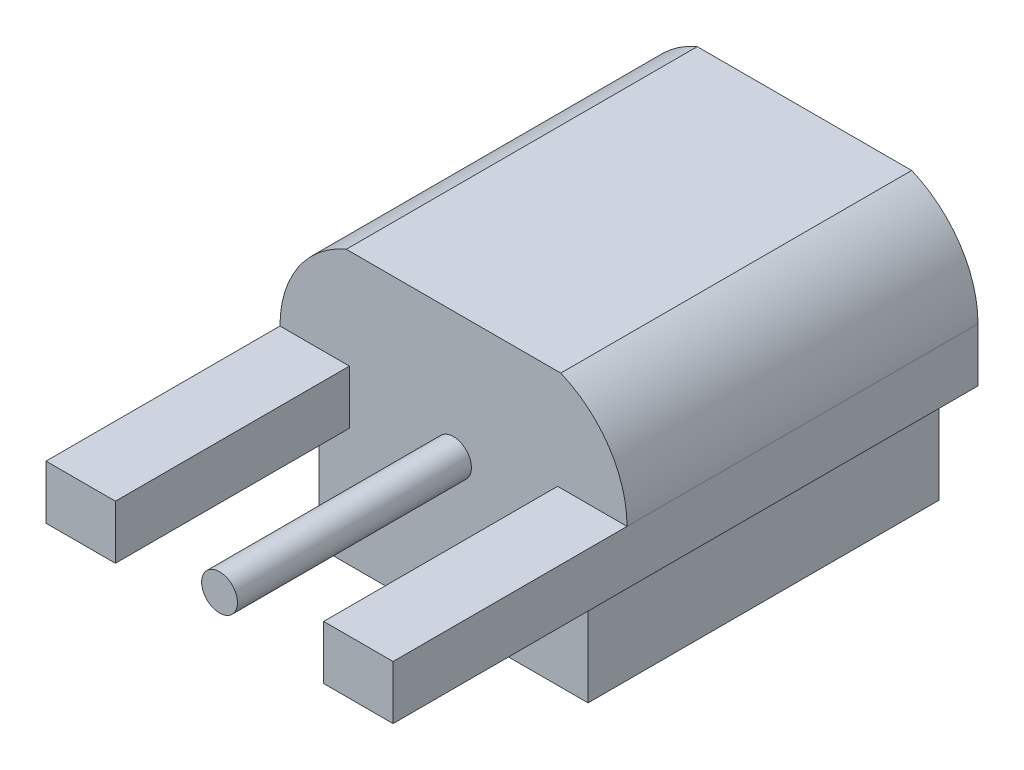
ISO-10303-21;
HEADER;
FILE_DESCRIPTION(('STEP AP214'),'2;1');
FILE_NAME('part.step','',(''),(''),'','','');
FILE_SCHEMA(('AUTOMOTIVE_DESIGN { 1 0 10303 214 1 1 1 1 }'));
ENDSEC;
DATA;
#1=APPLICATION_CONTEXT('core data for automotive mechanical design processes');
#2=APPLICATION_PROTOCOL_DEFINITION('international standard','automotive_design',2000,#1);
#3=PRODUCT_CONTEXT('',#1,'mechanical');
#4=PRODUCT('Part','Part','',(#3));
#5=PRODUCT_RELATED_PRODUCT_CATEGORY('part','',(#4));
#6=PRODUCT_DEFINITION_FORMATION('','',#4);
#7=PRODUCT_DEFINITION_CONTEXT('part definition',#1,'design');
#8=PRODUCT_DEFINITION('design','',#6,#7);
#9=PRODUCT_DEFINITION_SHAPE('','',#8);
#10=(LENGTH_UNIT() NAMED_UNIT(*) SI_UNIT(.MILLI.,.METRE.));
#11=(NAMED_UNIT(*) PLANE_ANGLE_UNIT() SI_UNIT($,.RADIAN.));
#12=(NAMED_UNIT(*) SI_UNIT($,.STERADIAN.) SOLID_ANGLE_UNIT());
#13=UNCERTAINTY_MEASURE_WITH_UNIT(LENGTH_MEASURE(1.E-05),#10,'distance_accuracy_value','');
#14=(GEOMETRIC_REPRESENTATION_CONTEXT(3) GLOBAL_UNCERTAINTY_ASSIGNED_CONTEXT((#13)) GLOBAL_UNIT_ASSIGNED_CONTEXT((#10,
#11,#12)) REPRESENTATION_CONTEXT('',''));
#15=CARTESIAN_POINT('',(0.,0.,0.));
#16=DIRECTION('',(0.,0.,1.));
#17=DIRECTION('',(1.,0.,0.));
#18=AXIS2_PLACEMENT_3D('',#15,#16,#17);
#19=CARTESIAN_POINT('',(2.225,0.345,0.));
#20=DIRECTION('',(0.,0.,-1.));
#21=DIRECTION('',(-1.,0.,0.));
#22=AXIS2_PLACEMENT_3D('',#19,#20,#21);
#23=CYLINDRICAL_SURFACE('',#22,0.229716396308532);
#24=CARTESIAN_POINT('',(2.225,0.345,0.));
#25=DIRECTION('',(0.,0.,1.));
#26=DIRECTION('',(1.,0.,0.));
#27=AXIS2_PLACEMENT_3D('',#24,#25,#26);
#28=CIRCLE('',#27,0.229716396308532);
#29=CARTESIAN_POINT('',(2.45471639630853,0.345,0.));
#30=VERTEX_POINT('',#29);
#31=EDGE_CURVE('E11',#30,#30,#28,.T.);
#32=ORIENTED_EDGE('',*,*,#31,.F.);
#33=EDGE_LOOP('',(#32));
#34=FACE_BOUND('',#33,.T.);
#35=CARTESIAN_POINT('',(2.225,0.345,-3.));
#36=DIRECTION('',(0.,0.,1.));
#37=DIRECTION('',(1.,0.,0.));
#38=AXIS2_PLACEMENT_3D('',#35,#36,#37);
#39=CIRCLE('',#38,0.229716396308532);
#40=CARTESIAN_POINT('',(2.45471639630853,0.345,-3.));
#41=VERTEX_POINT('',#40);
#42=EDGE_CURVE('E43',#41,#41,#39,.T.);
#43=ORIENTED_EDGE('',*,*,#42,.T.);
#44=EDGE_LOOP('',(#43));
#45=FACE_BOUND('',#44,.T.);
#46=ADVANCED_FACE('F40',(#34,#45),#23,.T.);
#47=CARTESIAN_POINT('',(2.225,0.345,0.));
#48=DIRECTION('',(0.,0.,1.));
#49=DIRECTION('',(1.,0.,0.));
#50=AXIS2_PLACEMENT_3D('',#47,#48,#49);
#51=PLANE('',#50);
#52=ORIENTED_EDGE('',*,*,#31,.T.);
#53=EDGE_LOOP('',(#52));
#54=FACE_BOUND('',#53,.T.);
#55=ADVANCED_FACE('F55',(#54),#51,.T.);
#56=CARTESIAN_POINT('',(2.225,0.345,-3.));
#57=DIRECTION('',(0.,0.,1.));
#58=DIRECTION('',(1.,0.,0.));
#59=AXIS2_PLACEMENT_3D('',#56,#57,#58);
#60=PLANE('',#59);
#61=ORIENTED_EDGE('',*,*,#42,.F.);
#62=EDGE_LOOP('',(#61));
#63=FACE_BOUND('',#62,.T.);
#64=ADVANCED_FACE('F53',(#63),#60,.F.);
#65=CLOSED_SHELL('',(#46,#55,#64));
#66=MANIFOLD_SOLID_BREP('B2',#65);
#67=CARTESIAN_POINT('',(0.,0.69,0.));
#68=DIRECTION('',(0.,-1.,0.));
#69=DIRECTION('',(0.,0.,-1.));
#70=AXIS2_PLACEMENT_3D('',#67,#68,#69);
#71=PLANE('',#70);
#72=DIRECTION('',(0.,0.,-1.));
#73=VECTOR('',#72,1.);
#74=CARTESIAN_POINT('',(4.45,0.69,-7.5));
#75=LINE('',#74,#73);
#76=CARTESIAN_POINT('',(4.45,0.69,0.));
#77=VERTEX_POINT('',#76);
#78=CARTESIAN_POINT('',(4.45,0.69,-3.));
#79=VERTEX_POINT('',#78);
#80=EDGE_CURVE('E214',#77,#79,#75,.T.);
#81=ORIENTED_EDGE('',*,*,#80,.T.);
#82=DIRECTION('',(-1.,0.,0.));
#83=VECTOR('',#82,1.);
#84=CARTESIAN_POINT('',(0.,0.69,-3.));
#85=LINE('',#84,#83);
#86=CARTESIAN_POINT('',(3.56,0.69,-3.));
#87=VERTEX_POINT('',#86);
#88=EDGE_CURVE('E189',#79,#87,#85,.T.);
#89=ORIENTED_EDGE('',*,*,#88,.T.);
#90=DIRECTION('',(0.,0.,1.));
#91=VECTOR('',#90,1.);
#92=CARTESIAN_POINT('',(3.56,0.69,0.));
#93=LINE('',#92,#91);
#94=CARTESIAN_POINT('',(3.56,0.69,0.));
#95=VERTEX_POINT('',#94);
#96=EDGE_CURVE('E227',#87,#95,#93,.T.);
#97=ORIENTED_EDGE('',*,*,#96,.T.);
#98=DIRECTION('',(1.,0.,0.));
#99=VECTOR('',#98,1.);
#100=CARTESIAN_POINT('',(4.45,0.69,0.));
#101=LINE('',#100,#99);
#102=EDGE_CURVE('E221',#95,#77,#101,.T.);
#103=ORIENTED_EDGE('',*,*,#102,.T.);
#104=EDGE_LOOP('',(#81,#89,#97,#103));
#105=FACE_BOUND('',#104,.T.);
#106=ADVANCED_FACE('F80',(#105),#71,.F.);
#107=CARTESIAN_POINT('',(0.,0.,0.));
#108=DIRECTION('',(0.,-1.,0.));
#109=DIRECTION('',(0.,0.,-1.));
#110=AXIS2_PLACEMENT_3D('',#107,#108,#109);
#111=PLANE('',#110);
#112=DIRECTION('',(0.,0.,-1.));
#113=VECTOR('',#112,1.);
#114=CARTESIAN_POINT('',(0.5,0.,-7.5));
#115=LINE('',#114,#113);
#116=CARTESIAN_POINT('',(0.5,0.,-3.));
#117=VERTEX_POINT('',#116);
#118=CARTESIAN_POINT('',(0.5,0.,-7.5));
#119=VERTEX_POINT('',#118);
#120=EDGE_CURVE('E105',#117,#119,#115,.T.);
#121=ORIENTED_EDGE('',*,*,#120,.F.);
#122=DIRECTION('',(-1.,0.,0.));
#123=VECTOR('',#122,1.);
#124=CARTESIAN_POINT('',(0.5,0.,-3.));
#125=LINE('',#124,#123);
#126=CARTESIAN_POINT('',(0.89,0.,-3.));
#127=VERTEX_POINT('',#126);
#128=EDGE_CURVE('E89',#127,#117,#125,.T.);
#129=ORIENTED_EDGE('',*,*,#128,.F.);
#130=DIRECTION('',(0.,0.,-1.));
#131=VECTOR('',#130,1.);
#132=CARTESIAN_POINT('',(0.89,0.,-3.));
#133=LINE('',#132,#131);
#134=CARTESIAN_POINT('',(0.89,0.,0.));
#135=VERTEX_POINT('',#134);
#136=EDGE_CURVE('E245',#135,#127,#133,.T.);
#137=ORIENTED_EDGE('',*,*,#136,.F.);
#138=DIRECTION('',(1.,0.,0.));
#139=VECTOR('',#138,1.);
#140=CARTESIAN_POINT('',(0.89,0.,0.));
#141=LINE('',#140,#139);
#142=CARTESIAN_POINT('',(0.,0.,0.));
#143=VERTEX_POINT('',#142);
#144=EDGE_CURVE('E242',#143,#135,#141,.T.);
#145=ORIENTED_EDGE('',*,*,#144,.F.);
#146=DIRECTION('',(0.,0.,1.));
#147=VECTOR('',#146,1.);
#148=CARTESIAN_POINT('',(0.,0.,0.));
#149=LINE('',#148,#147);
#150=CARTESIAN_POINT('',(0.,0.,-7.5));
#151=VERTEX_POINT('',#150);
#152=EDGE_CURVE('E239',#151,#143,#149,.T.);
#153=ORIENTED_EDGE('',*,*,#152,.F.);
#154=DIRECTION('',(-1.,0.,0.));
#155=VECTOR('',#154,1.);
#156=CARTESIAN_POINT('',(0.,0.,-7.5));
#157=LINE('',#156,#155);
#158=EDGE_CURVE('E251',#119,#151,#157,.T.);
#159=ORIENTED_EDGE('',*,*,#158,.F.);
#160=EDGE_LOOP('',(#121,#129,#137,#145,#153,#159));
#161=FACE_BOUND('',#160,.T.);
#162=ADVANCED_FACE('F393',(#161),#111,.T.);
#163=CARTESIAN_POINT('',(0.,0.69,0.));
#164=DIRECTION('',(1.,0.,0.));
#165=DIRECTION('',(0.,0.,-1.));
#166=AXIS2_PLACEMENT_3D('',#163,#164,#165);
#167=PLANE('',#166);
#168=ORIENTED_EDGE('',*,*,#152,.T.);
#169=DIRECTION('',(0.,-1.,0.));
#170=VECTOR('',#169,1.);
#171=CARTESIAN_POINT('',(0.,0.69,0.));
#172=LINE('',#171,#170);
#173=CARTESIAN_POINT('',(0.,0.69,0.));
#174=VERTEX_POINT('',#173);
#175=EDGE_CURVE('E262',#174,#143,#172,.T.);
#176=ORIENTED_EDGE('',*,*,#175,.F.);
#177=DIRECTION('',(0.,0.,1.));
#178=VECTOR('',#177,1.);
#179=CARTESIAN_POINT('',(0.,0.69,0.));
#180=LINE('',#179,#178);
#181=CARTESIAN_POINT('',(0.,0.69,-3.));
#182=VERTEX_POINT('',#181);
#183=EDGE_CURVE('E261',#182,#174,#180,.T.);
#184=ORIENTED_EDGE('',*,*,#183,.F.);
#185=CARTESIAN_POINT('',(0.,0.69,-7.5));
#186=VERTEX_POINT('',#185);
#187=EDGE_CURVE('E231',#186,#182,#180,.T.);
#188=ORIENTED_EDGE('',*,*,#187,.F.);
#189=DIRECTION('',(0.,-1.,0.));
#190=VECTOR('',#189,1.);
#191=CARTESIAN_POINT('',(0.,0.69,-7.5));
#192=LINE('',#191,#190);
#193=EDGE_CURVE('E223',#186,#151,#192,.T.);
#194=ORIENTED_EDGE('',*,*,#193,.T.);
#195=EDGE_LOOP('',(#168,#176,#184,#188,#194));
#196=FACE_BOUND('',#195,.T.);
#197=ADVANCED_FACE('F82',(#196),#167,.F.);
#198=CARTESIAN_POINT('',(0.89,0.69,0.));
#199=DIRECTION('',(0.,0.,-1.));
#200=DIRECTION('',(-1.,0.,0.));
#201=AXIS2_PLACEMENT_3D('',#198,#199,#200);
#202=PLANE('',#201);
#203=ORIENTED_EDGE('',*,*,#144,.T.);
#204=DIRECTION('',(0.,-1.,0.));
#205=VECTOR('',#204,1.);
#206=CARTESIAN_POINT('',(0.89,0.69,0.));
#207=LINE('',#206,#205);
#208=CARTESIAN_POINT('',(0.89,0.69,0.));
#209=VERTEX_POINT('',#208);
#210=EDGE_CURVE('E265',#209,#135,#207,.T.);
#211=ORIENTED_EDGE('',*,*,#210,.F.);
#212=DIRECTION('',(1.,0.,0.));
#213=VECTOR('',#212,1.);
#214=CARTESIAN_POINT('',(0.89,0.69,0.));
#215=LINE('',#214,#213);
#216=EDGE_CURVE('E319',#174,#209,#215,.T.);
#217=ORIENTED_EDGE('',*,*,#216,.F.);
#218=ORIENTED_EDGE('',*,*,#175,.T.);
#219=EDGE_LOOP('',(#203,#211,#217,#218));
#220=FACE_BOUND('',#219,.T.);
#221=ADVANCED_FACE('F423',(#220),#202,.F.);
#222=CARTESIAN_POINT('',(0.89,0.69,-3.));
#223=DIRECTION('',(-1.,0.,0.));
#224=DIRECTION('',(0.,0.,1.));
#225=AXIS2_PLACEMENT_3D('',#222,#223,#224);
#226=PLANE('',#225);
#227=ORIENTED_EDGE('',*,*,#136,.T.);
#228=DIRECTION('',(0.,-1.,0.));
#229=VECTOR('',#228,1.);
#230=CARTESIAN_POINT('',(0.89,0.69,-3.));
#231=LINE('',#230,#229);
#232=CARTESIAN_POINT('',(0.89,0.69,-3.));
#233=VERTEX_POINT('',#232);
#234=EDGE_CURVE('E268',#233,#127,#231,.T.);
#235=ORIENTED_EDGE('',*,*,#234,.F.);
#236=DIRECTION('',(0.,0.,-1.));
#237=VECTOR('',#236,1.);
#238=CARTESIAN_POINT('',(0.89,0.69,-3.));
#239=LINE('',#238,#237);
#240=EDGE_CURVE('E343',#209,#233,#239,.T.);
#241=ORIENTED_EDGE('',*,*,#240,.F.);
#242=ORIENTED_EDGE('',*,*,#210,.T.);
#243=EDGE_LOOP('',(#227,#235,#241,#242));
#244=FACE_BOUND('',#243,.T.);
#245=ADVANCED_FACE('F336',(#244),#226,.F.);
#246=CARTESIAN_POINT('',(3.56,0.69,-3.));
#247=DIRECTION('',(0.,0.,-1.));
#248=DIRECTION('',(-1.,0.,0.));
#249=AXIS2_PLACEMENT_3D('',#246,#247,#248);
#250=PLANE('',#249);
#251=ORIENTED_EDGE('',*,*,#234,.T.);
#252=ORIENTED_EDGE('',*,*,#128,.T.);
#253=DIRECTION('',(0.,1.,0.));
#254=VECTOR('',#253,1.);
#255=CARTESIAN_POINT('',(0.5,-1.52,-3.));
#256=LINE('',#255,#254);
#257=CARTESIAN_POINT('',(0.5,-1.52,-3.));
#258=VERTEX_POINT('',#257);
#259=EDGE_CURVE('E315',#258,#117,#256,.T.);
#260=ORIENTED_EDGE('',*,*,#259,.F.);
#261=DIRECTION('',(-1.,0.,0.));
#262=VECTOR('',#261,1.);
#263=CARTESIAN_POINT('',(0.5,-1.52,-3.));
#264=LINE('',#263,#262);
#265=CARTESIAN_POINT('',(3.95,-1.52,-3.));
#266=VERTEX_POINT('',#265);
#267=EDGE_CURVE('E313',#266,#258,#264,.T.);
#268=ORIENTED_EDGE('',*,*,#267,.F.);
#269=DIRECTION('',(0.,1.,0.));
#270=VECTOR('',#269,1.);
#271=CARTESIAN_POINT('',(3.95,-1.52,-3.));
#272=LINE('',#271,#270);
#273=CARTESIAN_POINT('',(3.95,0.,-3.));
#274=VERTEX_POINT('',#273);
#275=EDGE_CURVE('E301',#266,#274,#272,.T.);
#276=ORIENTED_EDGE('',*,*,#275,.T.);
#277=CARTESIAN_POINT('',(3.56,0.,-3.));
#278=VERTEX_POINT('',#277);
#279=EDGE_CURVE('E287',#274,#278,#125,.T.);
#280=ORIENTED_EDGE('',*,*,#279,.T.);
#281=DIRECTION('',(0.,-1.,0.));
#282=VECTOR('',#281,1.);
#283=CARTESIAN_POINT('',(3.56,0.69,-3.));
#284=LINE('',#283,#282);
#285=EDGE_CURVE('E196',#87,#278,#284,.T.);
#286=ORIENTED_EDGE('',*,*,#285,.F.);
#287=ORIENTED_EDGE('',*,*,#88,.F.);
#288=CARTESIAN_POINT('',(3.06511635639883,0.69,-3.));
#289=DIRECTION('',(0.,0.,-1.));
#290=DIRECTION('',(1.,0.,0.));
#291=AXIS2_PLACEMENT_3D('',#288,#289,#290);
#292=CIRCLE('',#291,1.38488364360117);
#293=CARTESIAN_POINT('',(3.6,1.96742013218909,-3.));
#294=VERTEX_POINT('',#293);
#295=EDGE_CURVE('E193',#294,#79,#292,.T.);
#296=ORIENTED_EDGE('',*,*,#295,.F.);
#297=DIRECTION('',(1.,0.,0.));
#298=VECTOR('',#297,1.);
#299=CARTESIAN_POINT('',(3.6,1.96742013218909,-3.));
#300=LINE('',#299,#298);
#301=CARTESIAN_POINT('',(0.85,1.96742013218909,-3.));
#302=VERTEX_POINT('',#301);
#303=EDGE_CURVE('E218',#302,#294,#300,.T.);
#304=ORIENTED_EDGE('',*,*,#303,.F.);
#305=CARTESIAN_POINT('',(1.38488364360117,0.69,-3.));
#306=DIRECTION('',(0.,0.,-1.));
#307=DIRECTION('',(-1.,0.,0.));
#308=AXIS2_PLACEMENT_3D('',#305,#306,#307);
#309=CIRCLE('',#308,1.38488364360117);
#310=EDGE_CURVE('E97',#182,#302,#309,.T.);
#311=ORIENTED_EDGE('',*,*,#310,.F.);
#312=EDGE_CURVE('E38',#233,#182,#85,.T.);
#313=ORIENTED_EDGE('',*,*,#312,.F.);
#314=EDGE_LOOP('',(#251,#252,#260,#268,#276,#280,#286,#287,#296,#304,#311,#313));
#315=FACE_BOUND('',#314,.T.);
#316=ADVANCED_FACE('F192',(#315),#250,.F.);
#317=CARTESIAN_POINT('',(3.56,0.69,0.));
#318=DIRECTION('',(1.,0.,0.));
#319=DIRECTION('',(0.,0.,-1.));
#320=AXIS2_PLACEMENT_3D('',#317,#318,#319);
#321=PLANE('',#320);
#322=DIRECTION('',(0.,0.,1.));
#323=VECTOR('',#322,1.);
#324=CARTESIAN_POINT('',(3.56,0.,0.));
#325=LINE('',#324,#323);
#326=CARTESIAN_POINT('',(3.56,0.,0.));
#327=VERTEX_POINT('',#326);
#328=EDGE_CURVE('E249',#278,#327,#325,.T.);
#329=ORIENTED_EDGE('',*,*,#328,.T.);
#330=DIRECTION('',(0.,-1.,0.));
#331=VECTOR('',#330,1.);
#332=CARTESIAN_POINT('',(3.56,0.69,0.));
#333=LINE('',#332,#331);
#334=EDGE_CURVE('E269',#95,#327,#333,.T.);
#335=ORIENTED_EDGE('',*,*,#334,.F.);
#336=ORIENTED_EDGE('',*,*,#96,.F.);
#337=ORIENTED_EDGE('',*,*,#285,.T.);
#338=EDGE_LOOP('',(#329,#335,#336,#337));
#339=FACE_BOUND('',#338,.T.);
#340=ADVANCED_FACE('F415',(#339),#321,.F.);
#341=CARTESIAN_POINT('',(4.45,0.69,0.));
#342=DIRECTION('',(0.,0.,-1.));
#343=DIRECTION('',(-1.,0.,0.));
#344=AXIS2_PLACEMENT_3D('',#341,#342,#343);
#345=PLANE('',#344);
#346=DIRECTION('',(1.,0.,0.));
#347=VECTOR('',#346,1.);
#348=CARTESIAN_POINT('',(4.45,0.,0.));
#349=LINE('',#348,#347);
#350=CARTESIAN_POINT('',(4.45,0.,0.));
#351=VERTEX_POINT('',#350);
#352=EDGE_CURVE('E246',#327,#351,#349,.T.);
#353=ORIENTED_EDGE('',*,*,#352,.T.);
#354=DIRECTION('',(0.,-1.,0.));
#355=VECTOR('',#354,1.);
#356=CARTESIAN_POINT('',(4.45,0.69,0.));
#357=LINE('',#356,#355);
#358=EDGE_CURVE('E272',#77,#351,#357,.T.);
#359=ORIENTED_EDGE('',*,*,#358,.F.);
#360=ORIENTED_EDGE('',*,*,#102,.F.);
#361=ORIENTED_EDGE('',*,*,#334,.T.);
#362=EDGE_LOOP('',(#353,#359,#360,#361));
#363=FACE_BOUND('',#362,.T.);
#364=ADVANCED_FACE('F409',(#363),#345,.F.);
#365=CARTESIAN_POINT('',(4.45,0.69,-7.5));
#366=DIRECTION('',(-1.,0.,0.));
#367=DIRECTION('',(0.,0.,1.));
#368=AXIS2_PLACEMENT_3D('',#365,#366,#367);
#369=PLANE('',#368);
#370=DIRECTION('',(0.,0.,-1.));
#371=VECTOR('',#370,1.);
#372=CARTESIAN_POINT('',(4.45,0.,-7.5));
#373=LINE('',#372,#371);
#374=CARTESIAN_POINT('',(4.45,0.,-7.5));
#375=VERTEX_POINT('',#374);
#376=EDGE_CURVE('E248',#351,#375,#373,.T.);
#377=ORIENTED_EDGE('',*,*,#376,.T.);
#378=DIRECTION('',(0.,-1.,0.));
#379=VECTOR('',#378,1.);
#380=CARTESIAN_POINT('',(4.45,0.69,-7.5));
#381=LINE('',#380,#379);
#382=CARTESIAN_POINT('',(4.45,0.69,-7.5));
#383=VERTEX_POINT('',#382);
#384=EDGE_CURVE('E216',#383,#375,#381,.T.);
#385=ORIENTED_EDGE('',*,*,#384,.F.);
#386=DIRECTION('',(0.,0.,-1.));
#387=VECTOR('',#386,1.);
#388=CARTESIAN_POINT('',(4.45,0.69,-3.));
#389=LINE('',#388,#387);
#390=EDGE_CURVE('E205',#79,#383,#389,.T.);
#391=ORIENTED_EDGE('',*,*,#390,.F.);
#392=ORIENTED_EDGE('',*,*,#80,.F.);
#393=ORIENTED_EDGE('',*,*,#358,.T.);
#394=EDGE_LOOP('',(#377,#385,#391,#392,#393));
#395=FACE_BOUND('',#394,.T.);
#396=ADVANCED_FACE('F212',(#395),#369,.F.);
#397=CARTESIAN_POINT('',(0.,0.69,-7.5));
#398=DIRECTION('',(0.,0.,1.));
#399=DIRECTION('',(1.,0.,0.));
#400=AXIS2_PLACEMENT_3D('',#397,#398,#399);
#401=PLANE('',#400);
#402=CARTESIAN_POINT('',(2.225,0.345,-7.5));
#403=DIRECTION('',(0.,0.,-1.));
#404=DIRECTION('',(-1.,0.,0.));
#405=AXIS2_PLACEMENT_3D('',#402,#403,#404);
#406=CIRCLE('',#405,1.19);
#407=CARTESIAN_POINT('',(1.035,0.345,-7.5));
#408=VERTEX_POINT('',#407);
#409=EDGE_CURVE('E488',#408,#408,#406,.T.);
#410=ORIENTED_EDGE('',*,*,#409,.F.);
#411=EDGE_LOOP('',(#410));
#412=FACE_BOUND('',#411,.T.);
#413=CARTESIAN_POINT('',(3.95,0.,-7.5));
#414=VERTEX_POINT('',#413);
#415=EDGE_CURVE('E258',#375,#414,#157,.T.);
#416=ORIENTED_EDGE('',*,*,#415,.T.);
#417=DIRECTION('',(0.,1.,0.));
#418=VECTOR('',#417,1.);
#419=CARTESIAN_POINT('',(3.95,-1.52,-7.5));
#420=LINE('',#419,#418);
#421=CARTESIAN_POINT('',(3.95,-1.52,-7.5));
#422=VERTEX_POINT('',#421);
#423=EDGE_CURVE('E299',#422,#414,#420,.T.);
#424=ORIENTED_EDGE('',*,*,#423,.F.);
#425=DIRECTION('',(1.,0.,0.));
#426=VECTOR('',#425,1.);
#427=CARTESIAN_POINT('',(0.5,-1.52,-7.5));
#428=LINE('',#427,#426);
#429=CARTESIAN_POINT('',(0.5,-1.52,-7.5));
#430=VERTEX_POINT('',#429);
#431=EDGE_CURVE('E372',#430,#422,#428,.T.);
#432=ORIENTED_EDGE('',*,*,#431,.F.);
#433=DIRECTION('',(0.,1.,0.));
#434=VECTOR('',#433,1.);
#435=CARTESIAN_POINT('',(0.5,-1.52,-7.5));
#436=LINE('',#435,#434);
#437=EDGE_CURVE('E243',#430,#119,#436,.T.);
#438=ORIENTED_EDGE('',*,*,#437,.T.);
#439=ORIENTED_EDGE('',*,*,#158,.T.);
#440=ORIENTED_EDGE('',*,*,#193,.F.);
#441=CARTESIAN_POINT('',(1.38488364360117,0.69,-7.5));
#442=DIRECTION('',(0.,0.,-1.));
#443=DIRECTION('',(-1.,0.,0.));
#444=AXIS2_PLACEMENT_3D('',#441,#442,#443);
#445=CIRCLE('',#444,1.38488364360117);
#446=CARTESIAN_POINT('',(0.85,1.96742013218909,-7.5));
#447=VERTEX_POINT('',#446);
#448=EDGE_CURVE('E363',#186,#447,#445,.T.);
#449=ORIENTED_EDGE('',*,*,#448,.T.);
#450=DIRECTION('',(1.,0.,0.));
#451=VECTOR('',#450,1.);
#452=CARTESIAN_POINT('',(3.6,1.96742013218909,-7.5));
#453=LINE('',#452,#451);
#454=CARTESIAN_POINT('',(3.6,1.96742013218909,-7.5));
#455=VERTEX_POINT('',#454);
#456=EDGE_CURVE('E208',#447,#455,#453,.T.);
#457=ORIENTED_EDGE('',*,*,#456,.T.);
#458=CARTESIAN_POINT('',(3.06511635639883,0.69,-7.5));
#459=DIRECTION('',(0.,0.,-1.));
#460=DIRECTION('',(1.,0.,0.));
#461=AXIS2_PLACEMENT_3D('',#458,#459,#460);
#462=CIRCLE('',#461,1.38488364360117);
#463=EDGE_CURVE('E279',#455,#383,#462,.T.);
#464=ORIENTED_EDGE('',*,*,#463,.T.);
#465=ORIENTED_EDGE('',*,*,#384,.T.);
#466=EDGE_LOOP('',(#416,#424,#432,#438,#439,#440,#449,#457,#464,#465));
#467=FACE_BOUND('',#466,.T.);
#468=ADVANCED_FACE('F275',(#412,#467),#401,.F.);
#469=ORIENTED_EDGE('',*,*,#240,.T.);
#470=ORIENTED_EDGE('',*,*,#312,.T.);
#471=ORIENTED_EDGE('',*,*,#183,.T.);
#472=ORIENTED_EDGE('',*,*,#216,.T.);
#473=EDGE_LOOP('',(#469,#470,#471,#472));
#474=FACE_BOUND('',#473,.T.);
#475=ADVANCED_FACE('F344',(#474),#71,.F.);
#476=ORIENTED_EDGE('',*,*,#279,.F.);
#477=DIRECTION('',(0.,0.,1.));
#478=VECTOR('',#477,1.);
#479=CARTESIAN_POINT('',(3.95,0.,-7.5));
#480=LINE('',#479,#478);
#481=EDGE_CURVE('E285',#414,#274,#480,.T.);
#482=ORIENTED_EDGE('',*,*,#481,.F.);
#483=ORIENTED_EDGE('',*,*,#415,.F.);
#484=ORIENTED_EDGE('',*,*,#376,.F.);
#485=ORIENTED_EDGE('',*,*,#352,.F.);
#486=ORIENTED_EDGE('',*,*,#328,.F.);
#487=EDGE_LOOP('',(#476,#482,#483,#484,#485,#486));
#488=FACE_BOUND('',#487,.T.);
#489=ADVANCED_FACE('F282',(#488),#111,.T.);
#490=CARTESIAN_POINT('',(0.5,-1.52,-7.5));
#491=DIRECTION('',(1.,0.,0.));
#492=DIRECTION('',(0.,0.,-1.));
#493=AXIS2_PLACEMENT_3D('',#490,#491,#492);
#494=PLANE('',#493);
#495=ORIENTED_EDGE('',*,*,#120,.T.);
#496=ORIENTED_EDGE('',*,*,#437,.F.);
#497=DIRECTION('',(0.,0.,-1.));
#498=VECTOR('',#497,1.);
#499=CARTESIAN_POINT('',(0.5,-1.52,-7.5));
#500=LINE('',#499,#498);
#501=EDGE_CURVE('E292',#258,#430,#500,.T.);
#502=ORIENTED_EDGE('',*,*,#501,.F.);
#503=ORIENTED_EDGE('',*,*,#259,.T.);
#504=EDGE_LOOP('',(#495,#496,#502,#503));
#505=FACE_BOUND('',#504,.T.);
#506=ADVANCED_FACE('F381',(#505),#494,.F.);
#507=CARTESIAN_POINT('',(3.95,-1.52,-7.5));
#508=DIRECTION('',(-1.,0.,0.));
#509=DIRECTION('',(0.,0.,1.));
#510=AXIS2_PLACEMENT_3D('',#507,#508,#509);
#511=PLANE('',#510);
#512=ORIENTED_EDGE('',*,*,#481,.T.);
#513=ORIENTED_EDGE('',*,*,#275,.F.);
#514=DIRECTION('',(0.,0.,1.));
#515=VECTOR('',#514,1.);
#516=CARTESIAN_POINT('',(3.95,-1.52,-7.5));
#517=LINE('',#516,#515);
#518=EDGE_CURVE('E373',#422,#266,#517,.T.);
#519=ORIENTED_EDGE('',*,*,#518,.F.);
#520=ORIENTED_EDGE('',*,*,#423,.T.);
#521=EDGE_LOOP('',(#512,#513,#519,#520));
#522=FACE_BOUND('',#521,.T.);
#523=ADVANCED_FACE('F383',(#522),#511,.F.);
#524=CARTESIAN_POINT('',(0.,-1.52,0.));
#525=DIRECTION('',(0.,1.,0.));
#526=DIRECTION('',(0.,0.,1.));
#527=AXIS2_PLACEMENT_3D('',#524,#525,#526);
#528=PLANE('',#527);
#529=ORIENTED_EDGE('',*,*,#501,.T.);
#530=ORIENTED_EDGE('',*,*,#431,.T.);
#531=ORIENTED_EDGE('',*,*,#518,.T.);
#532=ORIENTED_EDGE('',*,*,#267,.T.);
#533=EDGE_LOOP('',(#529,#530,#531,#532));
#534=FACE_BOUND('',#533,.T.);
#535=ADVANCED_FACE('F377',(#534),#528,.F.);
#536=CARTESIAN_POINT('',(3.06511635639883,0.69,-3.));
#537=DIRECTION('',(0.,0.,-1.));
#538=DIRECTION('',(-1.,0.,0.));
#539=AXIS2_PLACEMENT_3D('',#536,#537,#538);
#540=CYLINDRICAL_SURFACE('',#539,1.38488364360117);
#541=ORIENTED_EDGE('',*,*,#463,.F.);
#542=DIRECTION('',(0.,0.,-1.));
#543=VECTOR('',#542,1.);
#544=CARTESIAN_POINT('',(3.6,1.96742013218909,-3.));
#545=LINE('',#544,#543);
#546=EDGE_CURVE('E207',#294,#455,#545,.T.);
#547=ORIENTED_EDGE('',*,*,#546,.F.);
#548=ORIENTED_EDGE('',*,*,#295,.T.);
#549=ORIENTED_EDGE('',*,*,#390,.T.);
#550=EDGE_LOOP('',(#541,#547,#548,#549));
#551=FACE_BOUND('',#550,.T.);
#552=ADVANCED_FACE('F204',(#551),#540,.T.);
#553=CARTESIAN_POINT('',(3.6,1.96742013218909,-3.));
#554=DIRECTION('',(0.,1.,0.));
#555=DIRECTION('',(0.,0.,1.));
#556=AXIS2_PLACEMENT_3D('',#553,#554,#555);
#557=PLANE('',#556);
#558=ORIENTED_EDGE('',*,*,#456,.F.);
#559=DIRECTION('',(0.,0.,-1.));
#560=VECTOR('',#559,1.);
#561=CARTESIAN_POINT('',(0.85,1.96742013218909,-3.));
#562=LINE('',#561,#560);
#563=EDGE_CURVE('E217',#302,#447,#562,.T.);
#564=ORIENTED_EDGE('',*,*,#563,.F.);
#565=ORIENTED_EDGE('',*,*,#303,.T.);
#566=ORIENTED_EDGE('',*,*,#546,.T.);
#567=EDGE_LOOP('',(#558,#564,#565,#566));
#568=FACE_BOUND('',#567,.T.);
#569=ADVANCED_FACE('F434',(#568),#557,.T.);
#570=CARTESIAN_POINT('',(1.38488364360117,0.69,-3.));
#571=DIRECTION('',(0.,0.,-1.));
#572=DIRECTION('',(-1.,0.,0.));
#573=AXIS2_PLACEMENT_3D('',#570,#571,#572);
#574=CYLINDRICAL_SURFACE('',#573,1.38488364360117);
#575=ORIENTED_EDGE('',*,*,#448,.F.);
#576=ORIENTED_EDGE('',*,*,#187,.T.);
#577=ORIENTED_EDGE('',*,*,#310,.T.);
#578=ORIENTED_EDGE('',*,*,#563,.T.);
#579=EDGE_LOOP('',(#575,#576,#577,#578));
#580=FACE_BOUND('',#579,.T.);
#581=ADVANCED_FACE('F435',(#580),#574,.T.);
#582=CARTESIAN_POINT('',(2.225,0.345,-4.5));
#583=DIRECTION('',(0.,0.,-1.));
#584=DIRECTION('',(-1.,0.,0.));
#585=AXIS2_PLACEMENT_3D('',#582,#583,#584);
#586=CYLINDRICAL_SURFACE('',#585,1.19);
#587=CARTESIAN_POINT('',(2.225,0.345,-4.5));
#588=DIRECTION('',(0.,0.,-1.));
#589=DIRECTION('',(-1.,0.,0.));
#590=AXIS2_PLACEMENT_3D('',#587,#588,#589);
#591=CIRCLE('',#590,1.19);
#592=CARTESIAN_POINT('',(1.035,0.345,-4.5));
#593=VERTEX_POINT('',#592);
#594=EDGE_CURVE('E364',#593,#593,#591,.T.);
#595=ORIENTED_EDGE('',*,*,#594,.F.);
#596=EDGE_LOOP('',(#595));
#597=FACE_BOUND('',#596,.T.);
#598=ORIENTED_EDGE('',*,*,#409,.T.);
#599=EDGE_LOOP('',(#598));
#600=FACE_BOUND('',#599,.T.);
#601=ADVANCED_FACE('F437',(#597,#600),#586,.F.);
#602=CARTESIAN_POINT('',(2.225,0.345,-4.5));
#603=DIRECTION('',(0.,0.,-1.));
#604=DIRECTION('',(-1.,0.,0.));
#605=AXIS2_PLACEMENT_3D('',#602,#603,#604);
#606=PLANE('',#605);
#607=ORIENTED_EDGE('',*,*,#594,.T.);
#608=EDGE_LOOP('',(#607));
#609=FACE_BOUND('',#608,.T.);
#610=ADVANCED_FACE('F443',(#609),#606,.T.);
#611=CLOSED_SHELL('',(#106,#162,#197,#221,#245,#316,#340,#364,#396,#468,#475,#489,#506,#523,
#535,#552,#569,#581,#601,#610));
#612=MANIFOLD_SOLID_BREP('B6',#611);
#613=ADVANCED_BREP_SHAPE_REPRESENTATION('',(#18,#66,#612),#14);
#614=SHAPE_DEFINITION_REPRESENTATION(#9,#613);
ENDSEC;
END-ISO-10303-21;
